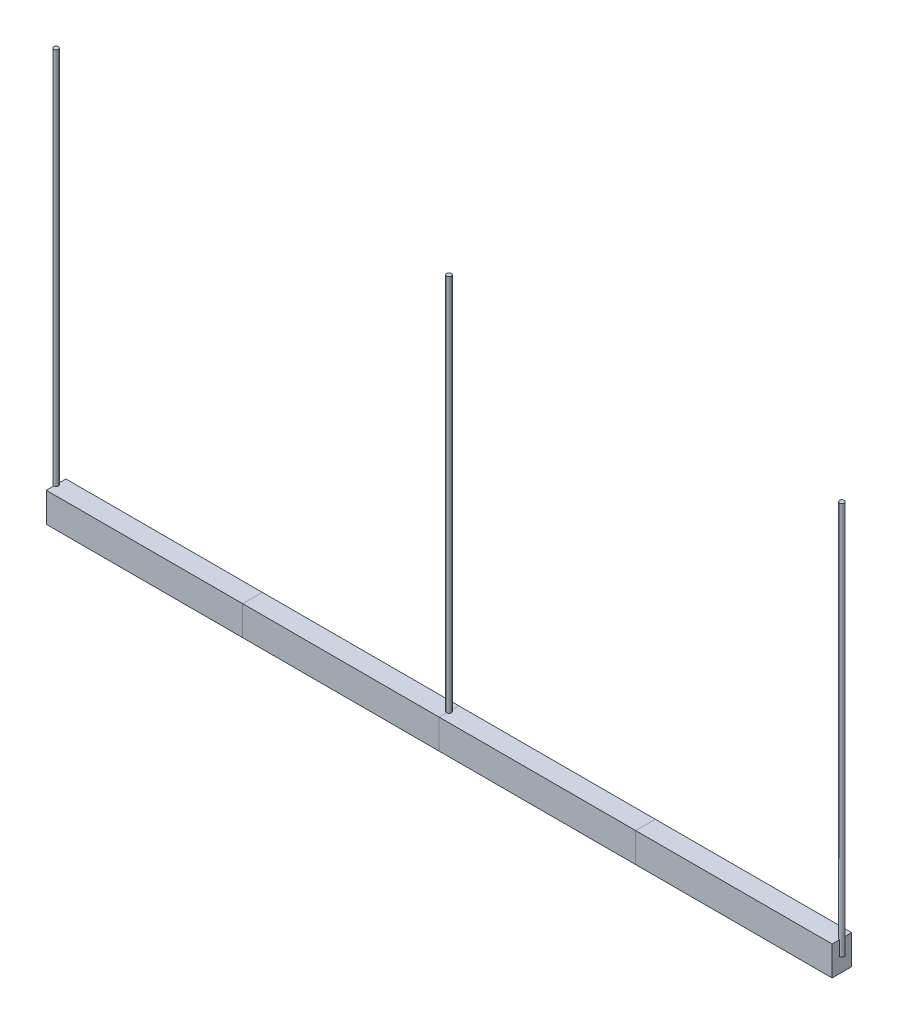
ISO-10303-21;
HEADER;
FILE_DESCRIPTION(('STEP AP214'),'2;1');
FILE_NAME('part.step','',(''),(''),'','','');
FILE_SCHEMA(('AUTOMOTIVE_DESIGN { 1 0 10303 214 1 1 1 1 }'));
ENDSEC;
DATA;
#1=APPLICATION_CONTEXT('core data for automotive mechanical design processes');
#2=APPLICATION_PROTOCOL_DEFINITION('international standard','automotive_design',2000,#1);
#3=PRODUCT_CONTEXT('',#1,'mechanical');
#4=PRODUCT('Part','Part','',(#3));
#5=PRODUCT_RELATED_PRODUCT_CATEGORY('part','',(#4));
#6=PRODUCT_DEFINITION_FORMATION('','',#4);
#7=PRODUCT_DEFINITION_CONTEXT('part definition',#1,'design');
#8=PRODUCT_DEFINITION('design','',#6,#7);
#9=PRODUCT_DEFINITION_SHAPE('','',#8);
#10=(LENGTH_UNIT() NAMED_UNIT(*) SI_UNIT(.MILLI.,.METRE.));
#11=(NAMED_UNIT(*) PLANE_ANGLE_UNIT() SI_UNIT($,.RADIAN.));
#12=(NAMED_UNIT(*) SI_UNIT($,.STERADIAN.) SOLID_ANGLE_UNIT());
#13=UNCERTAINTY_MEASURE_WITH_UNIT(LENGTH_MEASURE(1.E-05),#10,'distance_accuracy_value','');
#14=(GEOMETRIC_REPRESENTATION_CONTEXT(3) GLOBAL_UNCERTAINTY_ASSIGNED_CONTEXT((#13)) GLOBAL_UNIT_ASSIGNED_CONTEXT((#10,
#11,#12)) REPRESENTATION_CONTEXT('',''));
#15=CARTESIAN_POINT('',(0.,0.,0.));
#16=DIRECTION('',(0.,0.,1.));
#17=DIRECTION('',(1.,0.,0.));
#18=AXIS2_PLACEMENT_3D('',#15,#16,#17);
#19=CARTESIAN_POINT('',(4000.,2000.,0.));
#20=DIRECTION('',(0.,-1.,0.));
#21=DIRECTION('',(0.,0.,-1.));
#22=AXIS2_PLACEMENT_3D('',#19,#20,#21);
#23=CYLINDRICAL_SURFACE('',#22,11.9999999999997);
#24=CARTESIAN_POINT('',(4000.,2000.,0.));
#25=DIRECTION('',(0.,1.,0.));
#26=DIRECTION('',(0.,0.,1.));
#27=AXIS2_PLACEMENT_3D('',#24,#25,#26);
#28=CIRCLE('',#27,11.9999999999997);
#29=CARTESIAN_POINT('',(4000.,2000.,11.9999999999997));
#30=VERTEX_POINT('',#29);
#31=EDGE_CURVE('E11',#30,#30,#28,.T.);
#32=ORIENTED_EDGE('',*,*,#31,.F.);
#33=EDGE_LOOP('',(#32));
#34=FACE_BOUND('',#33,.T.);
#35=CARTESIAN_POINT('',(4000.,0.,0.));
#36=DIRECTION('',(0.,1.,0.));
#37=DIRECTION('',(0.,0.,1.));
#38=AXIS2_PLACEMENT_3D('',#35,#36,#37);
#39=CIRCLE('',#38,11.9999999999997);
#40=CARTESIAN_POINT('',(4000.,0.,11.9999999999997));
#41=VERTEX_POINT('',#40);
#42=EDGE_CURVE('E49',#41,#41,#39,.T.);
#43=ORIENTED_EDGE('',*,*,#42,.T.);
#44=EDGE_LOOP('',(#43));
#45=FACE_BOUND('',#44,.T.);
#46=ADVANCED_FACE('F46',(#34,#45),#23,.T.);
#47=CARTESIAN_POINT('',(4000.,2000.,0.));
#48=DIRECTION('',(0.,1.,0.));
#49=DIRECTION('',(0.,0.,1.));
#50=AXIS2_PLACEMENT_3D('',#47,#48,#49);
#51=PLANE('',#50);
#52=ORIENTED_EDGE('',*,*,#31,.T.);
#53=EDGE_LOOP('',(#52));
#54=FACE_BOUND('',#53,.T.);
#55=ADVANCED_FACE('F61',(#54),#51,.T.);
#56=CARTESIAN_POINT('',(4000.,0.,0.));
#57=DIRECTION('',(0.,1.,0.));
#58=DIRECTION('',(0.,0.,1.));
#59=AXIS2_PLACEMENT_3D('',#56,#57,#58);
#60=PLANE('',#59);
#61=ORIENTED_EDGE('',*,*,#42,.F.);
#62=EDGE_LOOP('',(#61));
#63=FACE_BOUND('',#62,.T.);
#64=ADVANCED_FACE('F59',(#63),#60,.F.);
#65=CLOSED_SHELL('',(#46,#55,#64));
#66=MANIFOLD_SOLID_BREP('B2',#65);
#67=CARTESIAN_POINT('',(2000.,2000.,0.));
#68=DIRECTION('',(0.,-1.,0.));
#69=DIRECTION('',(0.,0.,-1.));
#70=AXIS2_PLACEMENT_3D('',#67,#68,#69);
#71=CYLINDRICAL_SURFACE('',#70,12.0000000000002);
#72=CARTESIAN_POINT('',(2000.,2000.,0.));
#73=DIRECTION('',(0.,1.,0.));
#74=DIRECTION('',(0.,0.,1.));
#75=AXIS2_PLACEMENT_3D('',#72,#73,#74);
#76=CIRCLE('',#75,12.0000000000002);
#77=CARTESIAN_POINT('',(2000.,2000.,12.0000000000002));
#78=VERTEX_POINT('',#77);
#79=EDGE_CURVE('E45',#78,#78,#76,.T.);
#80=ORIENTED_EDGE('',*,*,#79,.F.);
#81=EDGE_LOOP('',(#80));
#82=FACE_BOUND('',#81,.T.);
#83=CARTESIAN_POINT('',(2000.,0.,0.));
#84=DIRECTION('',(0.,1.,0.));
#85=DIRECTION('',(0.,0.,1.));
#86=AXIS2_PLACEMENT_3D('',#83,#84,#85);
#87=CIRCLE('',#86,12.0000000000002);
#88=CARTESIAN_POINT('',(2000.,0.,12.0000000000002));
#89=VERTEX_POINT('',#88);
#90=EDGE_CURVE('E98',#89,#89,#87,.T.);
#91=ORIENTED_EDGE('',*,*,#90,.T.);
#92=EDGE_LOOP('',(#91));
#93=FACE_BOUND('',#92,.T.);
#94=ADVANCED_FACE('F95',(#82,#93),#71,.T.);
#95=CARTESIAN_POINT('',(2000.,2000.,0.));
#96=DIRECTION('',(0.,1.,0.));
#97=DIRECTION('',(0.,0.,1.));
#98=AXIS2_PLACEMENT_3D('',#95,#96,#97);
#99=PLANE('',#98);
#100=ORIENTED_EDGE('',*,*,#79,.T.);
#101=EDGE_LOOP('',(#100));
#102=FACE_BOUND('',#101,.T.);
#103=ADVANCED_FACE('F110',(#102),#99,.T.);
#104=CARTESIAN_POINT('',(2000.,0.,0.));
#105=DIRECTION('',(0.,1.,0.));
#106=DIRECTION('',(0.,0.,1.));
#107=AXIS2_PLACEMENT_3D('',#104,#105,#106);
#108=PLANE('',#107);
#109=ORIENTED_EDGE('',*,*,#90,.F.);
#110=EDGE_LOOP('',(#109));
#111=FACE_BOUND('',#110,.T.);
#112=ADVANCED_FACE('F108',(#111),#108,.F.);
#113=CLOSED_SHELL('',(#94,#103,#112));
#114=MANIFOLD_SOLID_BREP('B6',#113);
#115=CARTESIAN_POINT('',(0.,2000.,0.));
#116=DIRECTION('',(0.,-1.,0.));
#117=DIRECTION('',(0.,0.,-1.));
#118=AXIS2_PLACEMENT_3D('',#115,#116,#117);
#119=CYLINDRICAL_SURFACE('',#118,12.);
#120=CARTESIAN_POINT('',(0.,2000.,0.));
#121=DIRECTION('',(0.,1.,0.));
#122=DIRECTION('',(0.,0.,1.));
#123=AXIS2_PLACEMENT_3D('',#120,#121,#122);
#124=CIRCLE('',#123,12.);
#125=CARTESIAN_POINT('',(0.,2000.,12.));
#126=VERTEX_POINT('',#125);
#127=EDGE_CURVE('E94',#126,#126,#124,.T.);
#128=ORIENTED_EDGE('',*,*,#127,.F.);
#129=EDGE_LOOP('',(#128));
#130=FACE_BOUND('',#129,.T.);
#131=CARTESIAN_POINT('',(0.,0.,0.));
#132=DIRECTION('',(0.,1.,0.));
#133=DIRECTION('',(0.,0.,1.));
#134=AXIS2_PLACEMENT_3D('',#131,#132,#133);
#135=CIRCLE('',#134,12.);
#136=CARTESIAN_POINT('',(0.,0.,12.));
#137=VERTEX_POINT('',#136);
#138=EDGE_CURVE('E149',#137,#137,#135,.T.);
#139=ORIENTED_EDGE('',*,*,#138,.T.);
#140=EDGE_LOOP('',(#139));
#141=FACE_BOUND('',#140,.T.);
#142=ADVANCED_FACE('F146',(#130,#141),#119,.T.);
#143=CARTESIAN_POINT('',(0.,2000.,0.));
#144=DIRECTION('',(0.,1.,0.));
#145=DIRECTION('',(0.,0.,1.));
#146=AXIS2_PLACEMENT_3D('',#143,#144,#145);
#147=PLANE('',#146);
#148=ORIENTED_EDGE('',*,*,#127,.T.);
#149=EDGE_LOOP('',(#148));
#150=FACE_BOUND('',#149,.T.);
#151=ADVANCED_FACE('F161',(#150),#147,.T.);
#152=CARTESIAN_POINT('',(0.,0.,0.));
#153=DIRECTION('',(0.,1.,0.));
#154=DIRECTION('',(0.,0.,1.));
#155=AXIS2_PLACEMENT_3D('',#152,#153,#154);
#156=PLANE('',#155);
#157=ORIENTED_EDGE('',*,*,#138,.F.);
#158=EDGE_LOOP('',(#157));
#159=FACE_BOUND('',#158,.T.);
#160=ADVANCED_FACE('F159',(#159),#156,.F.);
#161=CLOSED_SHELL('',(#142,#151,#160));
#162=MANIFOLD_SOLID_BREP('B40',#161);
#163=CARTESIAN_POINT('',(4000.,75.,-50.));
#164=DIRECTION('',(0.,-1.,0.));
#165=DIRECTION('',(0.,0.,-1.));
#166=AXIS2_PLACEMENT_3D('',#163,#164,#165);
#167=PLANE('',#166);
#168=DIRECTION('',(0.,0.,1.));
#169=VECTOR('',#168,1.);
#170=CARTESIAN_POINT('',(3000.,75.,-50.));
#171=LINE('',#170,#169);
#172=CARTESIAN_POINT('',(3000.,75.,-50.));
#173=VERTEX_POINT('',#172);
#174=CARTESIAN_POINT('',(3000.,75.,50.));
#175=VERTEX_POINT('',#174);
#176=EDGE_CURVE('E260',#173,#175,#171,.T.);
#177=ORIENTED_EDGE('',*,*,#176,.T.);
#178=DIRECTION('',(-1.,0.,0.));
#179=VECTOR('',#178,1.);
#180=CARTESIAN_POINT('',(4000.,75.,50.));
#181=LINE('',#180,#179);
#182=CARTESIAN_POINT('',(4000.,75.,50.));
#183=VERTEX_POINT('',#182);
#184=EDGE_CURVE('E144',#183,#175,#181,.T.);
#185=ORIENTED_EDGE('',*,*,#184,.F.);
#186=DIRECTION('',(0.,0.,1.));
#187=VECTOR('',#186,1.);
#188=CARTESIAN_POINT('',(4000.,75.,-50.));
#189=LINE('',#188,#187);
#190=CARTESIAN_POINT('',(4000.,75.,-50.));
#191=VERTEX_POINT('',#190);
#192=EDGE_CURVE('E248',#191,#183,#189,.T.);
#193=ORIENTED_EDGE('',*,*,#192,.F.);
#194=DIRECTION('',(-1.,0.,0.));
#195=VECTOR('',#194,1.);
#196=CARTESIAN_POINT('',(4000.,75.,-50.));
#197=LINE('',#196,#195);
#198=EDGE_CURVE('E256',#191,#173,#197,.T.);
#199=ORIENTED_EDGE('',*,*,#198,.T.);
#200=EDGE_LOOP('',(#177,#185,#193,#199));
#201=FACE_BOUND('',#200,.T.);
#202=ADVANCED_FACE('F197',(#201),#167,.F.);
#203=CARTESIAN_POINT('',(4000.,75.,50.));
#204=DIRECTION('',(0.,0.,-1.));
#205=DIRECTION('',(0.,1.,0.));
#206=AXIS2_PLACEMENT_3D('',#203,#204,#205);
#207=PLANE('',#206);
#208=DIRECTION('',(0.,-1.,0.));
#209=VECTOR('',#208,1.);
#210=CARTESIAN_POINT('',(3000.,75.,50.));
#211=LINE('',#210,#209);
#212=CARTESIAN_POINT('',(3000.,-75.,50.));
#213=VERTEX_POINT('',#212);
#214=EDGE_CURVE('E252',#175,#213,#211,.T.);
#215=ORIENTED_EDGE('',*,*,#214,.T.);
#216=DIRECTION('',(-1.,0.,0.));
#217=VECTOR('',#216,1.);
#218=CARTESIAN_POINT('',(4000.,-75.,50.));
#219=LINE('',#218,#217);
#220=CARTESIAN_POINT('',(4000.,-75.,50.));
#221=VERTEX_POINT('',#220);
#222=EDGE_CURVE('E205',#221,#213,#219,.T.);
#223=ORIENTED_EDGE('',*,*,#222,.F.);
#224=DIRECTION('',(0.,-1.,0.));
#225=VECTOR('',#224,1.);
#226=CARTESIAN_POINT('',(4000.,75.,50.));
#227=LINE('',#226,#225);
#228=EDGE_CURVE('E243',#183,#221,#227,.T.);
#229=ORIENTED_EDGE('',*,*,#228,.F.);
#230=ORIENTED_EDGE('',*,*,#184,.T.);
#231=EDGE_LOOP('',(#215,#223,#229,#230));
#232=FACE_BOUND('',#231,.T.);
#233=ADVANCED_FACE('F251',(#232),#207,.F.);
#234=CARTESIAN_POINT('',(4000.,-75.,50.));
#235=DIRECTION('',(0.,1.,0.));
#236=DIRECTION('',(0.,0.,1.));
#237=AXIS2_PLACEMENT_3D('',#234,#235,#236);
#238=PLANE('',#237);
#239=DIRECTION('',(0.,0.,-1.));
#240=VECTOR('',#239,1.);
#241=CARTESIAN_POINT('',(3000.,-75.,50.));
#242=LINE('',#241,#240);
#243=CARTESIAN_POINT('',(3000.,-75.,-50.));
#244=VERTEX_POINT('',#243);
#245=EDGE_CURVE('E230',#213,#244,#242,.T.);
#246=ORIENTED_EDGE('',*,*,#245,.T.);
#247=DIRECTION('',(-1.,0.,0.));
#248=VECTOR('',#247,1.);
#249=CARTESIAN_POINT('',(4000.,-75.,-50.));
#250=LINE('',#249,#248);
#251=CARTESIAN_POINT('',(4000.,-75.,-50.));
#252=VERTEX_POINT('',#251);
#253=EDGE_CURVE('E253',#252,#244,#250,.T.);
#254=ORIENTED_EDGE('',*,*,#253,.F.);
#255=DIRECTION('',(0.,0.,-1.));
#256=VECTOR('',#255,1.);
#257=CARTESIAN_POINT('',(4000.,-75.,50.));
#258=LINE('',#257,#256);
#259=EDGE_CURVE('E246',#221,#252,#258,.T.);
#260=ORIENTED_EDGE('',*,*,#259,.F.);
#261=ORIENTED_EDGE('',*,*,#222,.T.);
#262=EDGE_LOOP('',(#246,#254,#260,#261));
#263=FACE_BOUND('',#262,.T.);
#264=ADVANCED_FACE('F254',(#263),#238,.F.);
#265=CARTESIAN_POINT('',(4000.,-75.,-50.));
#266=DIRECTION('',(0.,0.,1.));
#267=DIRECTION('',(0.,-1.,0.));
#268=AXIS2_PLACEMENT_3D('',#265,#266,#267);
#269=PLANE('',#268);
#270=DIRECTION('',(0.,1.,0.));
#271=VECTOR('',#270,1.);
#272=CARTESIAN_POINT('',(3000.,-75.,-50.));
#273=LINE('',#272,#271);
#274=EDGE_CURVE('E236',#244,#173,#273,.T.);
#275=ORIENTED_EDGE('',*,*,#274,.T.);
#276=ORIENTED_EDGE('',*,*,#198,.F.);
#277=DIRECTION('',(0.,1.,0.));
#278=VECTOR('',#277,1.);
#279=CARTESIAN_POINT('',(4000.,-75.,-50.));
#280=LINE('',#279,#278);
#281=EDGE_CURVE('E213',#252,#191,#280,.T.);
#282=ORIENTED_EDGE('',*,*,#281,.F.);
#283=ORIENTED_EDGE('',*,*,#253,.T.);
#284=EDGE_LOOP('',(#275,#276,#282,#283));
#285=FACE_BOUND('',#284,.T.);
#286=ADVANCED_FACE('F267',(#285),#269,.F.);
#287=CARTESIAN_POINT('',(4000.,0.,0.));
#288=DIRECTION('',(1.,0.,0.));
#289=DIRECTION('',(0.,0.,-1.));
#290=AXIS2_PLACEMENT_3D('',#287,#288,#289);
#291=PLANE('',#290);
#292=ORIENTED_EDGE('',*,*,#192,.T.);
#293=ORIENTED_EDGE('',*,*,#228,.T.);
#294=ORIENTED_EDGE('',*,*,#259,.T.);
#295=ORIENTED_EDGE('',*,*,#281,.T.);
#296=EDGE_LOOP('',(#292,#293,#294,#295));
#297=FACE_BOUND('',#296,.T.);
#298=ADVANCED_FACE('F244',(#297),#291,.T.);
#299=CARTESIAN_POINT('',(3000.,0.,0.));
#300=DIRECTION('',(1.,0.,0.));
#301=DIRECTION('',(0.,0.,-1.));
#302=AXIS2_PLACEMENT_3D('',#299,#300,#301);
#303=PLANE('',#302);
#304=ORIENTED_EDGE('',*,*,#176,.F.);
#305=ORIENTED_EDGE('',*,*,#274,.F.);
#306=ORIENTED_EDGE('',*,*,#245,.F.);
#307=ORIENTED_EDGE('',*,*,#214,.F.);
#308=EDGE_LOOP('',(#304,#305,#306,#307));
#309=FACE_BOUND('',#308,.T.);
#310=ADVANCED_FACE('F270',(#309),#303,.F.);
#311=CLOSED_SHELL('',(#202,#233,#264,#286,#298,#310));
#312=MANIFOLD_SOLID_BREP('B89',#311);
#313=CARTESIAN_POINT('',(3000.,75.,50.));
#314=DIRECTION('',(0.,0.,-1.));
#315=DIRECTION('',(0.,1.,0.));
#316=AXIS2_PLACEMENT_3D('',#313,#314,#315);
#317=PLANE('',#316);
#318=DIRECTION('',(0.,-1.,0.));
#319=VECTOR('',#318,1.);
#320=CARTESIAN_POINT('',(2000.,75.,50.));
#321=LINE('',#320,#319);
#322=CARTESIAN_POINT('',(2000.,75.,50.));
#323=VERTEX_POINT('',#322);
#324=CARTESIAN_POINT('',(2000.,-75.,50.));
#325=VERTEX_POINT('',#324);
#326=EDGE_CURVE('E394',#323,#325,#321,.T.);
#327=ORIENTED_EDGE('',*,*,#326,.T.);
#328=DIRECTION('',(-1.,0.,0.));
#329=VECTOR('',#328,1.);
#330=CARTESIAN_POINT('',(3000.,-75.,50.));
#331=LINE('',#330,#329);
#332=CARTESIAN_POINT('',(3000.,-75.,50.));
#333=VERTEX_POINT('',#332);
#334=EDGE_CURVE('E195',#333,#325,#331,.T.);
#335=ORIENTED_EDGE('',*,*,#334,.F.);
#336=DIRECTION('',(0.,-1.,0.));
#337=VECTOR('',#336,1.);
#338=CARTESIAN_POINT('',(3000.,75.,50.));
#339=LINE('',#338,#337);
#340=CARTESIAN_POINT('',(3000.,75.,50.));
#341=VERTEX_POINT('',#340);
#342=EDGE_CURVE('E382',#341,#333,#339,.T.);
#343=ORIENTED_EDGE('',*,*,#342,.F.);
#344=DIRECTION('',(-1.,0.,0.));
#345=VECTOR('',#344,1.);
#346=CARTESIAN_POINT('',(3000.,75.,50.));
#347=LINE('',#346,#345);
#348=EDGE_CURVE('E390',#341,#323,#347,.T.);
#349=ORIENTED_EDGE('',*,*,#348,.T.);
#350=EDGE_LOOP('',(#327,#335,#343,#349));
#351=FACE_BOUND('',#350,.T.);
#352=ADVANCED_FACE('F331',(#351),#317,.F.);
#353=CARTESIAN_POINT('',(3000.,-75.,50.));
#354=DIRECTION('',(0.,1.,0.));
#355=DIRECTION('',(0.,0.,1.));
#356=AXIS2_PLACEMENT_3D('',#353,#354,#355);
#357=PLANE('',#356);
#358=DIRECTION('',(0.,0.,-1.));
#359=VECTOR('',#358,1.);
#360=CARTESIAN_POINT('',(2000.,-75.,50.));
#361=LINE('',#360,#359);
#362=CARTESIAN_POINT('',(2000.,-75.,-50.));
#363=VERTEX_POINT('',#362);
#364=EDGE_CURVE('E386',#325,#363,#361,.T.);
#365=ORIENTED_EDGE('',*,*,#364,.T.);
#366=DIRECTION('',(-1.,0.,0.));
#367=VECTOR('',#366,1.);
#368=CARTESIAN_POINT('',(3000.,-75.,-50.));
#369=LINE('',#368,#367);
#370=CARTESIAN_POINT('',(3000.,-75.,-50.));
#371=VERTEX_POINT('',#370);
#372=EDGE_CURVE('E339',#371,#363,#369,.T.);
#373=ORIENTED_EDGE('',*,*,#372,.F.);
#374=DIRECTION('',(0.,0.,-1.));
#375=VECTOR('',#374,1.);
#376=CARTESIAN_POINT('',(3000.,-75.,50.));
#377=LINE('',#376,#375);
#378=EDGE_CURVE('E377',#333,#371,#377,.T.);
#379=ORIENTED_EDGE('',*,*,#378,.F.);
#380=ORIENTED_EDGE('',*,*,#334,.T.);
#381=EDGE_LOOP('',(#365,#373,#379,#380));
#382=FACE_BOUND('',#381,.T.);
#383=ADVANCED_FACE('F385',(#382),#357,.F.);
#384=CARTESIAN_POINT('',(3000.,-75.,-50.));
#385=DIRECTION('',(0.,0.,1.));
#386=DIRECTION('',(0.,-1.,0.));
#387=AXIS2_PLACEMENT_3D('',#384,#385,#386);
#388=PLANE('',#387);
#389=DIRECTION('',(0.,1.,0.));
#390=VECTOR('',#389,1.);
#391=CARTESIAN_POINT('',(2000.,-75.,-50.));
#392=LINE('',#391,#390);
#393=CARTESIAN_POINT('',(2000.,75.,-50.));
#394=VERTEX_POINT('',#393);
#395=EDGE_CURVE('E364',#363,#394,#392,.T.);
#396=ORIENTED_EDGE('',*,*,#395,.T.);
#397=DIRECTION('',(-1.,0.,0.));
#398=VECTOR('',#397,1.);
#399=CARTESIAN_POINT('',(3000.,75.,-50.));
#400=LINE('',#399,#398);
#401=CARTESIAN_POINT('',(3000.,75.,-50.));
#402=VERTEX_POINT('',#401);
#403=EDGE_CURVE('E387',#402,#394,#400,.T.);
#404=ORIENTED_EDGE('',*,*,#403,.F.);
#405=DIRECTION('',(0.,1.,0.));
#406=VECTOR('',#405,1.);
#407=CARTESIAN_POINT('',(3000.,-75.,-50.));
#408=LINE('',#407,#406);
#409=EDGE_CURVE('E380',#371,#402,#408,.T.);
#410=ORIENTED_EDGE('',*,*,#409,.F.);
#411=ORIENTED_EDGE('',*,*,#372,.T.);
#412=EDGE_LOOP('',(#396,#404,#410,#411));
#413=FACE_BOUND('',#412,.T.);
#414=ADVANCED_FACE('F388',(#413),#388,.F.);
#415=CARTESIAN_POINT('',(3000.,75.,-50.));
#416=DIRECTION('',(0.,-1.,0.));
#417=DIRECTION('',(0.,0.,-1.));
#418=AXIS2_PLACEMENT_3D('',#415,#416,#417);
#419=PLANE('',#418);
#420=DIRECTION('',(0.,0.,1.));
#421=VECTOR('',#420,1.);
#422=CARTESIAN_POINT('',(2000.,75.,-50.));
#423=LINE('',#422,#421);
#424=EDGE_CURVE('E370',#394,#323,#423,.T.);
#425=ORIENTED_EDGE('',*,*,#424,.T.);
#426=ORIENTED_EDGE('',*,*,#348,.F.);
#427=DIRECTION('',(0.,0.,1.));
#428=VECTOR('',#427,1.);
#429=CARTESIAN_POINT('',(3000.,75.,-50.));
#430=LINE('',#429,#428);
#431=EDGE_CURVE('E347',#402,#341,#430,.T.);
#432=ORIENTED_EDGE('',*,*,#431,.F.);
#433=ORIENTED_EDGE('',*,*,#403,.T.);
#434=EDGE_LOOP('',(#425,#426,#432,#433));
#435=FACE_BOUND('',#434,.T.);
#436=ADVANCED_FACE('F401',(#435),#419,.F.);
#437=CARTESIAN_POINT('',(3000.,0.,0.));
#438=DIRECTION('',(1.,0.,0.));
#439=DIRECTION('',(0.,0.,-1.));
#440=AXIS2_PLACEMENT_3D('',#437,#438,#439);
#441=PLANE('',#440);
#442=ORIENTED_EDGE('',*,*,#342,.T.);
#443=ORIENTED_EDGE('',*,*,#378,.T.);
#444=ORIENTED_EDGE('',*,*,#409,.T.);
#445=ORIENTED_EDGE('',*,*,#431,.T.);
#446=EDGE_LOOP('',(#442,#443,#444,#445));
#447=FACE_BOUND('',#446,.T.);
#448=ADVANCED_FACE('F378',(#447),#441,.T.);
#449=CARTESIAN_POINT('',(2000.,0.,0.));
#450=DIRECTION('',(1.,0.,0.));
#451=DIRECTION('',(0.,0.,-1.));
#452=AXIS2_PLACEMENT_3D('',#449,#450,#451);
#453=PLANE('',#452);
#454=ORIENTED_EDGE('',*,*,#326,.F.);
#455=ORIENTED_EDGE('',*,*,#424,.F.);
#456=ORIENTED_EDGE('',*,*,#395,.F.);
#457=ORIENTED_EDGE('',*,*,#364,.F.);
#458=EDGE_LOOP('',(#454,#455,#456,#457));
#459=FACE_BOUND('',#458,.T.);
#460=ADVANCED_FACE('F404',(#459),#453,.F.);
#461=CLOSED_SHELL('',(#352,#383,#414,#436,#448,#460));
#462=MANIFOLD_SOLID_BREP('B138',#461);
#463=CARTESIAN_POINT('',(2000.,-75.,50.));
#464=DIRECTION('',(0.,1.,0.));
#465=DIRECTION('',(0.,0.,1.));
#466=AXIS2_PLACEMENT_3D('',#463,#464,#465);
#467=PLANE('',#466);
#468=DIRECTION('',(0.,0.,-1.));
#469=VECTOR('',#468,1.);
#470=CARTESIAN_POINT('',(1000.,-75.,50.));
#471=LINE('',#470,#469);
#472=CARTESIAN_POINT('',(1000.,-75.,50.));
#473=VERTEX_POINT('',#472);
#474=CARTESIAN_POINT('',(1000.,-75.,-50.));
#475=VERTEX_POINT('',#474);
#476=EDGE_CURVE('E527',#473,#475,#471,.T.);
#477=ORIENTED_EDGE('',*,*,#476,.T.);
#478=DIRECTION('',(-1.,0.,0.));
#479=VECTOR('',#478,1.);
#480=CARTESIAN_POINT('',(2000.,-75.,-50.));
#481=LINE('',#480,#479);
#482=CARTESIAN_POINT('',(2000.,-75.,-50.));
#483=VERTEX_POINT('',#482);
#484=EDGE_CURVE('E329',#483,#475,#481,.T.);
#485=ORIENTED_EDGE('',*,*,#484,.F.);
#486=DIRECTION('',(0.,0.,-1.));
#487=VECTOR('',#486,1.);
#488=CARTESIAN_POINT('',(2000.,-75.,50.));
#489=LINE('',#488,#487);
#490=CARTESIAN_POINT('',(2000.,-75.,50.));
#491=VERTEX_POINT('',#490);
#492=EDGE_CURVE('E515',#491,#483,#489,.T.);
#493=ORIENTED_EDGE('',*,*,#492,.F.);
#494=DIRECTION('',(-1.,0.,0.));
#495=VECTOR('',#494,1.);
#496=CARTESIAN_POINT('',(2000.,-75.,50.));
#497=LINE('',#496,#495);
#498=EDGE_CURVE('E523',#491,#473,#497,.T.);
#499=ORIENTED_EDGE('',*,*,#498,.T.);
#500=EDGE_LOOP('',(#477,#485,#493,#499));
#501=FACE_BOUND('',#500,.T.);
#502=ADVANCED_FACE('F464',(#501),#467,.F.);
#503=CARTESIAN_POINT('',(2000.,-75.,-50.));
#504=DIRECTION('',(0.,0.,1.));
#505=DIRECTION('',(0.,-1.,0.));
#506=AXIS2_PLACEMENT_3D('',#503,#504,#505);
#507=PLANE('',#506);
#508=DIRECTION('',(0.,1.,0.));
#509=VECTOR('',#508,1.);
#510=CARTESIAN_POINT('',(1000.,-75.,-50.));
#511=LINE('',#510,#509);
#512=CARTESIAN_POINT('',(1000.,75.,-50.));
#513=VERTEX_POINT('',#512);
#514=EDGE_CURVE('E519',#475,#513,#511,.T.);
#515=ORIENTED_EDGE('',*,*,#514,.T.);
#516=DIRECTION('',(-1.,0.,0.));
#517=VECTOR('',#516,1.);
#518=CARTESIAN_POINT('',(2000.,75.,-50.));
#519=LINE('',#518,#517);
#520=CARTESIAN_POINT('',(2000.,75.,-50.));
#521=VERTEX_POINT('',#520);
#522=EDGE_CURVE('E472',#521,#513,#519,.T.);
#523=ORIENTED_EDGE('',*,*,#522,.F.);
#524=DIRECTION('',(0.,1.,0.));
#525=VECTOR('',#524,1.);
#526=CARTESIAN_POINT('',(2000.,-75.,-50.));
#527=LINE('',#526,#525);
#528=EDGE_CURVE('E510',#483,#521,#527,.T.);
#529=ORIENTED_EDGE('',*,*,#528,.F.);
#530=ORIENTED_EDGE('',*,*,#484,.T.);
#531=EDGE_LOOP('',(#515,#523,#529,#530));
#532=FACE_BOUND('',#531,.T.);
#533=ADVANCED_FACE('F518',(#532),#507,.F.);
#534=CARTESIAN_POINT('',(2000.,75.,-50.));
#535=DIRECTION('',(0.,-1.,0.));
#536=DIRECTION('',(0.,0.,-1.));
#537=AXIS2_PLACEMENT_3D('',#534,#535,#536);
#538=PLANE('',#537);
#539=DIRECTION('',(0.,0.,1.));
#540=VECTOR('',#539,1.);
#541=CARTESIAN_POINT('',(1000.,75.,-50.));
#542=LINE('',#541,#540);
#543=CARTESIAN_POINT('',(1000.,75.,50.));
#544=VERTEX_POINT('',#543);
#545=EDGE_CURVE('E497',#513,#544,#542,.T.);
#546=ORIENTED_EDGE('',*,*,#545,.T.);
#547=DIRECTION('',(-1.,0.,0.));
#548=VECTOR('',#547,1.);
#549=CARTESIAN_POINT('',(2000.,75.,50.));
#550=LINE('',#549,#548);
#551=CARTESIAN_POINT('',(2000.,75.,50.));
#552=VERTEX_POINT('',#551);
#553=EDGE_CURVE('E520',#552,#544,#550,.T.);
#554=ORIENTED_EDGE('',*,*,#553,.F.);
#555=DIRECTION('',(0.,0.,1.));
#556=VECTOR('',#555,1.);
#557=CARTESIAN_POINT('',(2000.,75.,-50.));
#558=LINE('',#557,#556);
#559=EDGE_CURVE('E513',#521,#552,#558,.T.);
#560=ORIENTED_EDGE('',*,*,#559,.F.);
#561=ORIENTED_EDGE('',*,*,#522,.T.);
#562=EDGE_LOOP('',(#546,#554,#560,#561));
#563=FACE_BOUND('',#562,.T.);
#564=ADVANCED_FACE('F521',(#563),#538,.F.);
#565=CARTESIAN_POINT('',(2000.,75.,50.));
#566=DIRECTION('',(0.,0.,-1.));
#567=DIRECTION('',(0.,1.,0.));
#568=AXIS2_PLACEMENT_3D('',#565,#566,#567);
#569=PLANE('',#568);
#570=DIRECTION('',(0.,-1.,0.));
#571=VECTOR('',#570,1.);
#572=CARTESIAN_POINT('',(1000.,75.,50.));
#573=LINE('',#572,#571);
#574=EDGE_CURVE('E503',#544,#473,#573,.T.);
#575=ORIENTED_EDGE('',*,*,#574,.T.);
#576=ORIENTED_EDGE('',*,*,#498,.F.);
#577=DIRECTION('',(0.,-1.,0.));
#578=VECTOR('',#577,1.);
#579=CARTESIAN_POINT('',(2000.,75.,50.));
#580=LINE('',#579,#578);
#581=EDGE_CURVE('E480',#552,#491,#580,.T.);
#582=ORIENTED_EDGE('',*,*,#581,.F.);
#583=ORIENTED_EDGE('',*,*,#553,.T.);
#584=EDGE_LOOP('',(#575,#576,#582,#583));
#585=FACE_BOUND('',#584,.T.);
#586=ADVANCED_FACE('F534',(#585),#569,.F.);
#587=CARTESIAN_POINT('',(2000.,0.,0.));
#588=DIRECTION('',(1.,0.,0.));
#589=DIRECTION('',(0.,0.,-1.));
#590=AXIS2_PLACEMENT_3D('',#587,#588,#589);
#591=PLANE('',#590);
#592=ORIENTED_EDGE('',*,*,#492,.T.);
#593=ORIENTED_EDGE('',*,*,#528,.T.);
#594=ORIENTED_EDGE('',*,*,#559,.T.);
#595=ORIENTED_EDGE('',*,*,#581,.T.);
#596=EDGE_LOOP('',(#592,#593,#594,#595));
#597=FACE_BOUND('',#596,.T.);
#598=ADVANCED_FACE('F511',(#597),#591,.T.);
#599=CARTESIAN_POINT('',(1000.,0.,0.));
#600=DIRECTION('',(1.,0.,0.));
#601=DIRECTION('',(0.,0.,-1.));
#602=AXIS2_PLACEMENT_3D('',#599,#600,#601);
#603=PLANE('',#602);
#604=ORIENTED_EDGE('',*,*,#476,.F.);
#605=ORIENTED_EDGE('',*,*,#574,.F.);
#606=ORIENTED_EDGE('',*,*,#545,.F.);
#607=ORIENTED_EDGE('',*,*,#514,.F.);
#608=EDGE_LOOP('',(#604,#605,#606,#607));
#609=FACE_BOUND('',#608,.T.);
#610=ADVANCED_FACE('F537',(#609),#603,.F.);
#611=CLOSED_SHELL('',(#502,#533,#564,#586,#598,#610));
#612=MANIFOLD_SOLID_BREP('B189',#611);
#613=CARTESIAN_POINT('',(1000.,75.,-50.));
#614=DIRECTION('',(0.,0.,1.));
#615=DIRECTION('',(0.,-1.,0.));
#616=AXIS2_PLACEMENT_3D('',#613,#614,#615);
#617=PLANE('',#616);
#618=DIRECTION('',(0.,1.,0.));
#619=VECTOR('',#618,1.);
#620=CARTESIAN_POINT('',(0.,75.,-50.));
#621=LINE('',#620,#619);
#622=CARTESIAN_POINT('',(0.,-75.,-50.));
#623=VERTEX_POINT('',#622);
#624=CARTESIAN_POINT('',(0.,75.,-50.));
#625=VERTEX_POINT('',#624);
#626=EDGE_CURVE('E651',#623,#625,#621,.T.);
#627=ORIENTED_EDGE('',*,*,#626,.T.);
#628=DIRECTION('',(-1.,0.,0.));
#629=VECTOR('',#628,1.);
#630=CARTESIAN_POINT('',(1000.,75.,-50.));
#631=LINE('',#630,#629);
#632=CARTESIAN_POINT('',(1000.,75.,-50.));
#633=VERTEX_POINT('',#632);
#634=EDGE_CURVE('E462',#633,#625,#631,.T.);
#635=ORIENTED_EDGE('',*,*,#634,.F.);
#636=DIRECTION('',(0.,1.,0.));
#637=VECTOR('',#636,1.);
#638=CARTESIAN_POINT('',(1000.,75.,-50.));
#639=LINE('',#638,#637);
#640=CARTESIAN_POINT('',(1000.,-75.,-50.));
#641=VERTEX_POINT('',#640);
#642=EDGE_CURVE('E639',#641,#633,#639,.T.);
#643=ORIENTED_EDGE('',*,*,#642,.F.);
#644=DIRECTION('',(-1.,0.,0.));
#645=VECTOR('',#644,1.);
#646=CARTESIAN_POINT('',(1000.,-75.,-50.));
#647=LINE('',#646,#645);
#648=EDGE_CURVE('E647',#641,#623,#647,.T.);
#649=ORIENTED_EDGE('',*,*,#648,.T.);
#650=EDGE_LOOP('',(#627,#635,#643,#649));
#651=FACE_BOUND('',#650,.T.);
#652=ADVANCED_FACE('F588',(#651),#617,.F.);
#653=CARTESIAN_POINT('',(1000.,75.,50.));
#654=DIRECTION('',(0.,-1.,0.));
#655=DIRECTION('',(0.,0.,-1.));
#656=AXIS2_PLACEMENT_3D('',#653,#654,#655);
#657=PLANE('',#656);
#658=DIRECTION('',(0.,0.,1.));
#659=VECTOR('',#658,1.);
#660=CARTESIAN_POINT('',(0.,75.,50.));
#661=LINE('',#660,#659);
#662=CARTESIAN_POINT('',(0.,75.,50.));
#663=VERTEX_POINT('',#662);
#664=EDGE_CURVE('E643',#625,#663,#661,.T.);
#665=ORIENTED_EDGE('',*,*,#664,.T.);
#666=DIRECTION('',(-1.,0.,0.));
#667=VECTOR('',#666,1.);
#668=CARTESIAN_POINT('',(1000.,75.,50.));
#669=LINE('',#668,#667);
#670=CARTESIAN_POINT('',(1000.,75.,50.));
#671=VERTEX_POINT('',#670);
#672=EDGE_CURVE('E596',#671,#663,#669,.T.);
#673=ORIENTED_EDGE('',*,*,#672,.F.);
#674=DIRECTION('',(0.,0.,1.));
#675=VECTOR('',#674,1.);
#676=CARTESIAN_POINT('',(1000.,75.,50.));
#677=LINE('',#676,#675);
#678=EDGE_CURVE('E634',#633,#671,#677,.T.);
#679=ORIENTED_EDGE('',*,*,#678,.F.);
#680=ORIENTED_EDGE('',*,*,#634,.T.);
#681=EDGE_LOOP('',(#665,#673,#679,#680));
#682=FACE_BOUND('',#681,.T.);
#683=ADVANCED_FACE('F642',(#682),#657,.F.);
#684=CARTESIAN_POINT('',(1000.,75.,50.));
#685=DIRECTION('',(0.,0.,-1.));
#686=DIRECTION('',(0.,1.,0.));
#687=AXIS2_PLACEMENT_3D('',#684,#685,#686);
#688=PLANE('',#687);
#689=DIRECTION('',(0.,-1.,0.));
#690=VECTOR('',#689,1.);
#691=CARTESIAN_POINT('',(0.,75.,50.));
#692=LINE('',#691,#690);
#693=CARTESIAN_POINT('',(0.,-75.,50.));
#694=VERTEX_POINT('',#693);
#695=EDGE_CURVE('E621',#663,#694,#692,.T.);
#696=ORIENTED_EDGE('',*,*,#695,.T.);
#697=DIRECTION('',(-1.,0.,0.));
#698=VECTOR('',#697,1.);
#699=CARTESIAN_POINT('',(1000.,-75.,50.));
#700=LINE('',#699,#698);
#701=CARTESIAN_POINT('',(1000.,-75.,50.));
#702=VERTEX_POINT('',#701);
#703=EDGE_CURVE('E644',#702,#694,#700,.T.);
#704=ORIENTED_EDGE('',*,*,#703,.F.);
#705=DIRECTION('',(0.,-1.,0.));
#706=VECTOR('',#705,1.);
#707=CARTESIAN_POINT('',(1000.,75.,50.));
#708=LINE('',#707,#706);
#709=EDGE_CURVE('E637',#671,#702,#708,.T.);
#710=ORIENTED_EDGE('',*,*,#709,.F.);
#711=ORIENTED_EDGE('',*,*,#672,.T.);
#712=EDGE_LOOP('',(#696,#704,#710,#711));
#713=FACE_BOUND('',#712,.T.);
#714=ADVANCED_FACE('F645',(#713),#688,.F.);
#715=CARTESIAN_POINT('',(1000.,-75.,50.));
#716=DIRECTION('',(0.,1.,0.));
#717=DIRECTION('',(0.,0.,1.));
#718=AXIS2_PLACEMENT_3D('',#715,#716,#717);
#719=PLANE('',#718);
#720=DIRECTION('',(0.,0.,-1.));
#721=VECTOR('',#720,1.);
#722=CARTESIAN_POINT('',(0.,-75.,50.));
#723=LINE('',#722,#721);
#724=EDGE_CURVE('E627',#694,#623,#723,.T.);
#725=ORIENTED_EDGE('',*,*,#724,.T.);
#726=ORIENTED_EDGE('',*,*,#648,.F.);
#727=DIRECTION('',(0.,0.,-1.));
#728=VECTOR('',#727,1.);
#729=CARTESIAN_POINT('',(1000.,-75.,50.));
#730=LINE('',#729,#728);
#731=EDGE_CURVE('E604',#702,#641,#730,.T.);
#732=ORIENTED_EDGE('',*,*,#731,.F.);
#733=ORIENTED_EDGE('',*,*,#703,.T.);
#734=EDGE_LOOP('',(#725,#726,#732,#733));
#735=FACE_BOUND('',#734,.T.);
#736=ADVANCED_FACE('F658',(#735),#719,.F.);
#737=CARTESIAN_POINT('',(1000.,0.,0.));
#738=DIRECTION('',(1.,0.,0.));
#739=DIRECTION('',(0.,0.,-1.));
#740=AXIS2_PLACEMENT_3D('',#737,#738,#739);
#741=PLANE('',#740);
#742=ORIENTED_EDGE('',*,*,#642,.T.);
#743=ORIENTED_EDGE('',*,*,#678,.T.);
#744=ORIENTED_EDGE('',*,*,#709,.T.);
#745=ORIENTED_EDGE('',*,*,#731,.T.);
#746=EDGE_LOOP('',(#742,#743,#744,#745));
#747=FACE_BOUND('',#746,.T.);
#748=ADVANCED_FACE('F635',(#747),#741,.T.);
#749=CARTESIAN_POINT('',(0.,0.,0.));
#750=DIRECTION('',(1.,0.,0.));
#751=DIRECTION('',(0.,0.,-1.));
#752=AXIS2_PLACEMENT_3D('',#749,#750,#751);
#753=PLANE('',#752);
#754=ORIENTED_EDGE('',*,*,#626,.F.);
#755=ORIENTED_EDGE('',*,*,#724,.F.);
#756=ORIENTED_EDGE('',*,*,#695,.F.);
#757=ORIENTED_EDGE('',*,*,#664,.F.);
#758=EDGE_LOOP('',(#754,#755,#756,#757));
#759=FACE_BOUND('',#758,.T.);
#760=ADVANCED_FACE('F661',(#759),#753,.F.);
#761=CLOSED_SHELL('',(#652,#683,#714,#736,#748,#760));
#762=MANIFOLD_SOLID_BREP('B323',#761);
#763=ADVANCED_BREP_SHAPE_REPRESENTATION('',(#18,#66,#114,#162,#312,#462,#612,#762),#14);
#764=SHAPE_DEFINITION_REPRESENTATION(#9,#763);
ENDSEC;
END-ISO-10303-21;
